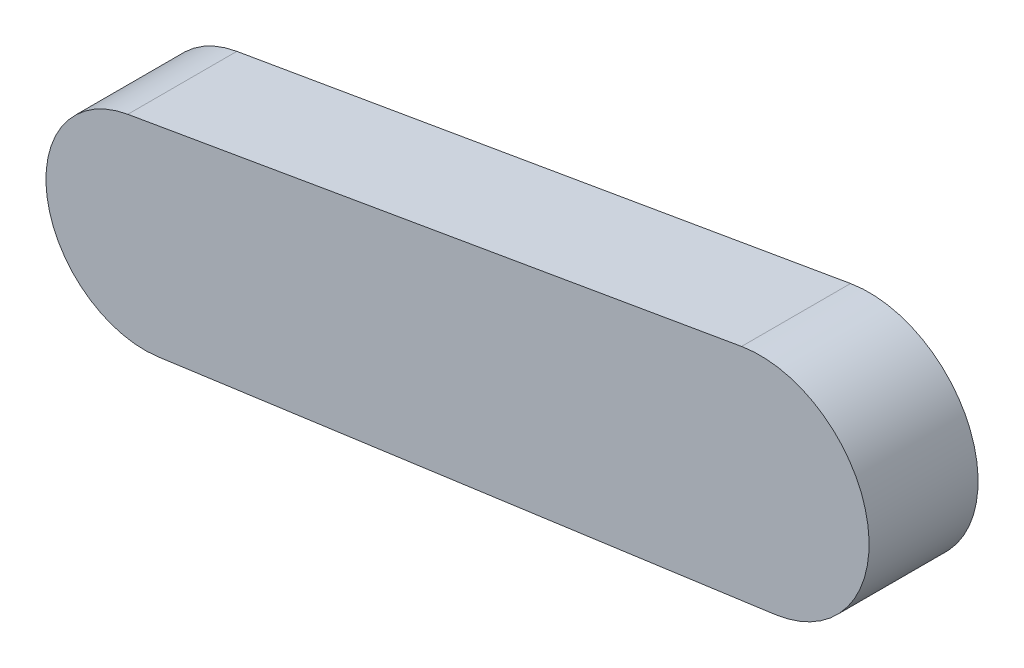
ISO-10303-21;
HEADER;
FILE_DESCRIPTION(('STEP AP214'),'2;1');
FILE_NAME('part.step','',(''),(''),'','','');
FILE_SCHEMA(('AUTOMOTIVE_DESIGN { 1 0 10303 214 1 1 1 1 }'));
ENDSEC;
DATA;
#1=APPLICATION_CONTEXT('core data for automotive mechanical design processes');
#2=APPLICATION_PROTOCOL_DEFINITION('international standard','automotive_design',2000,#1);
#3=PRODUCT_CONTEXT('',#1,'mechanical');
#4=PRODUCT('Part','Part','',(#3));
#5=PRODUCT_RELATED_PRODUCT_CATEGORY('part','',(#4));
#6=PRODUCT_DEFINITION_FORMATION('','',#4);
#7=PRODUCT_DEFINITION_CONTEXT('part definition',#1,'design');
#8=PRODUCT_DEFINITION('design','',#6,#7);
#9=PRODUCT_DEFINITION_SHAPE('','',#8);
#10=(LENGTH_UNIT() NAMED_UNIT(*) SI_UNIT(.MILLI.,.METRE.));
#11=(NAMED_UNIT(*) PLANE_ANGLE_UNIT() SI_UNIT($,.RADIAN.));
#12=(NAMED_UNIT(*) SI_UNIT($,.STERADIAN.) SOLID_ANGLE_UNIT());
#13=UNCERTAINTY_MEASURE_WITH_UNIT(LENGTH_MEASURE(1.E-05),#10,'distance_accuracy_value','');
#14=(GEOMETRIC_REPRESENTATION_CONTEXT(3) GLOBAL_UNCERTAINTY_ASSIGNED_CONTEXT((#13)) GLOBAL_UNIT_ASSIGNED_CONTEXT((#10,
#11,#12)) REPRESENTATION_CONTEXT('',''));
#15=CARTESIAN_POINT('',(0.,0.,0.));
#16=DIRECTION('',(0.,0.,1.));
#17=DIRECTION('',(1.,0.,0.));
#18=AXIS2_PLACEMENT_3D('',#15,#16,#17);
#19=CARTESIAN_POINT('',(-113.968011841731,660.94786327718,53.34));
#20=DIRECTION('',(-0.169923544106424,0.985457248772524,0.));
#21=DIRECTION('',(-0.985457248772524,-0.169923544106424,0.));
#22=AXIS2_PLACEMENT_3D('',#19,#20,#21);
#23=PLANE('',#22);
#24=DIRECTION('',(0.985457248772524,0.169923544106424,0.));
#25=VECTOR('',#24,1.);
#26=CARTESIAN_POINT('',(-113.968011841731,660.94786327718,0.));
#27=LINE('',#26,#25);
#28=CARTESIAN_POINT('',(-999.93937070584,508.178787335535,0.));
#29=VERTEX_POINT('',#28);
#30=CARTESIAN_POINT('',(-699.613721867637,559.964289649526,0.));
#31=VERTEX_POINT('',#30);
#32=EDGE_CURVE('E100',#29,#31,#27,.T.);
#33=ORIENTED_EDGE('',*,*,#32,.F.);
#34=DIRECTION('',(0.,0.,-1.));
#35=VECTOR('',#34,1.);
#36=CARTESIAN_POINT('',(-999.93937070584,508.178787335535,53.34));
#37=LINE('',#36,#35);
#38=CARTESIAN_POINT('',(-999.93937070584,508.178787335535,53.34));
#39=VERTEX_POINT('',#38);
#40=EDGE_CURVE('E11',#39,#29,#37,.T.);
#41=ORIENTED_EDGE('',*,*,#40,.F.);
#42=DIRECTION('',(0.985457248772524,0.169923544106424,0.));
#43=VECTOR('',#42,1.);
#44=CARTESIAN_POINT('',(-113.968011841731,660.94786327718,53.34));
#45=LINE('',#44,#43);
#46=CARTESIAN_POINT('',(-699.613721867637,559.964289649526,53.34));
#47=VERTEX_POINT('',#46);
#48=EDGE_CURVE('E85',#39,#47,#45,.T.);
#49=ORIENTED_EDGE('',*,*,#48,.T.);
#50=DIRECTION('',(0.,0.,-1.));
#51=VECTOR('',#50,1.);
#52=CARTESIAN_POINT('',(-699.613721867637,559.964289649526,53.34));
#53=LINE('',#52,#51);
#54=EDGE_CURVE('E53',#47,#31,#53,.T.);
#55=ORIENTED_EDGE('',*,*,#54,.T.);
#56=EDGE_LOOP('',(#33,#41,#49,#55));
#57=FACE_BOUND('',#56,.T.);
#58=ADVANCED_FACE('F37',(#57),#23,.T.);
#59=CARTESIAN_POINT('',(-991.738860467264,460.620620509774,53.34));
#60=DIRECTION('',(0.,0.,-1.));
#61=DIRECTION('',(-1.,0.,0.));
#62=AXIS2_PLACEMENT_3D('',#59,#60,#61);
#63=CYLINDRICAL_SURFACE('',#62,48.26);
#64=CARTESIAN_POINT('',(-991.738860467264,460.620620509774,0.));
#65=DIRECTION('',(0.,0.,1.));
#66=DIRECTION('',(1.,0.,0.));
#67=AXIS2_PLACEMENT_3D('',#64,#65,#66);
#68=CIRCLE('',#67,48.26);
#69=CARTESIAN_POINT('',(-985.127958103244,412.81556251448,0.));
#70=VERTEX_POINT('',#69);
#71=EDGE_CURVE('E91',#29,#70,#68,.T.);
#72=ORIENTED_EDGE('',*,*,#71,.T.);
#73=DIRECTION('',(0.,0.,-1.));
#74=VECTOR('',#73,1.);
#75=CARTESIAN_POINT('',(-985.127958103244,412.81556251448,53.34));
#76=LINE('',#75,#74);
#77=CARTESIAN_POINT('',(-985.127958103244,412.81556251448,53.34));
#78=VERTEX_POINT('',#77);
#79=EDGE_CURVE('E45',#78,#70,#76,.T.);
#80=ORIENTED_EDGE('',*,*,#79,.F.);
#81=CARTESIAN_POINT('',(-991.738860467264,460.620620509774,53.34));
#82=DIRECTION('',(0.,0.,1.));
#83=DIRECTION('',(1.,0.,0.));
#84=AXIS2_PLACEMENT_3D('',#81,#82,#83);
#85=CIRCLE('',#84,48.26);
#86=EDGE_CURVE('E79',#39,#78,#85,.T.);
#87=ORIENTED_EDGE('',*,*,#86,.F.);
#88=ORIENTED_EDGE('',*,*,#40,.T.);
#89=EDGE_LOOP('',(#72,#80,#87,#88));
#90=FACE_BOUND('',#89,.T.);
#91=ADVANCED_FACE('F89',(#90),#63,.T.);
#92=CARTESIAN_POINT('',(-74.502359296189,538.744850676477,53.34));
#93=DIRECTION('',(0.13698512979734,-0.990573103922374,0.));
#94=DIRECTION('',(0.990573103922374,0.13698512979734,0.));
#95=AXIS2_PLACEMENT_3D('',#92,#93,#94);
#96=PLANE('',#95);
#97=DIRECTION('',(-0.990573103922374,-0.13698512979734,0.));
#98=VECTOR('',#97,1.);
#99=CARTESIAN_POINT('',(-74.502359296189,538.744850676477,0.));
#100=LINE('',#99,#98);
#101=CARTESIAN_POINT('',(-683.243213201611,454.562830636781,0.));
#102=VERTEX_POINT('',#101);
#103=EDGE_CURVE('E103',#102,#70,#100,.T.);
#104=ORIENTED_EDGE('',*,*,#103,.F.);
#105=DIRECTION('',(0.,0.,-1.));
#106=VECTOR('',#105,1.);
#107=CARTESIAN_POINT('',(-683.243213201611,454.562830636781,53.34));
#108=LINE('',#107,#106);
#109=CARTESIAN_POINT('',(-683.243213201611,454.562830636781,53.34));
#110=VERTEX_POINT('',#109);
#111=EDGE_CURVE('E66',#110,#102,#108,.T.);
#112=ORIENTED_EDGE('',*,*,#111,.F.);
#113=DIRECTION('',(-0.990573103922374,-0.13698512979734,0.));
#114=VECTOR('',#113,1.);
#115=CARTESIAN_POINT('',(-74.502359296189,538.744850676477,53.34));
#116=LINE('',#115,#114);
#117=EDGE_CURVE('E84',#110,#78,#116,.T.);
#118=ORIENTED_EDGE('',*,*,#117,.T.);
#119=ORIENTED_EDGE('',*,*,#79,.T.);
#120=EDGE_LOOP('',(#104,#112,#118,#119));
#121=FACE_BOUND('',#120,.T.);
#122=ADVANCED_FACE('F94',(#121),#96,.T.);
#123=CARTESIAN_POINT('',(-690.550000025001,507.4,53.34));
#124=DIRECTION('',(0.,0.,-1.));
#125=DIRECTION('',(-1.,0.,0.));
#126=AXIS2_PLACEMENT_3D('',#123,#124,#125);
#127=CYLINDRICAL_SURFACE('',#126,53.3399999999999);
#128=CARTESIAN_POINT('',(-690.550000025001,507.4,0.));
#129=DIRECTION('',(0.,0.,1.));
#130=DIRECTION('',(1.,0.,0.));
#131=AXIS2_PLACEMENT_3D('',#128,#129,#130);
#132=CIRCLE('',#131,53.3399999999999);
#133=EDGE_CURVE('E105',#31,#102,#132,.F.);
#134=ORIENTED_EDGE('',*,*,#133,.F.);
#135=ORIENTED_EDGE('',*,*,#54,.F.);
#136=CARTESIAN_POINT('',(-690.550000025001,507.4,53.34));
#137=DIRECTION('',(0.,0.,1.));
#138=DIRECTION('',(1.,0.,0.));
#139=AXIS2_PLACEMENT_3D('',#136,#137,#138);
#140=CIRCLE('',#139,53.3399999999999);
#141=EDGE_CURVE('E95',#47,#110,#140,.F.);
#142=ORIENTED_EDGE('',*,*,#141,.T.);
#143=ORIENTED_EDGE('',*,*,#111,.T.);
#144=EDGE_LOOP('',(#134,#135,#142,#143));
#145=FACE_BOUND('',#144,.T.);
#146=ADVANCED_FACE('F110',(#145),#127,.T.);
#147=CARTESIAN_POINT('',(0.,0.,53.34));
#148=DIRECTION('',(0.,0.,1.));
#149=DIRECTION('',(1.,0.,0.));
#150=AXIS2_PLACEMENT_3D('',#147,#148,#149);
#151=PLANE('',#150);
#152=ORIENTED_EDGE('',*,*,#48,.F.);
#153=ORIENTED_EDGE('',*,*,#86,.T.);
#154=ORIENTED_EDGE('',*,*,#117,.F.);
#155=ORIENTED_EDGE('',*,*,#141,.F.);
#156=EDGE_LOOP('',(#152,#153,#154,#155));
#157=FACE_BOUND('',#156,.T.);
#158=ADVANCED_FACE('F81',(#157),#151,.T.);
#159=CARTESIAN_POINT('',(0.,0.,0.));
#160=DIRECTION('',(0.,0.,1.));
#161=DIRECTION('',(1.,0.,0.));
#162=AXIS2_PLACEMENT_3D('',#159,#160,#161);
#163=PLANE('',#162);
#164=ORIENTED_EDGE('',*,*,#32,.T.);
#165=ORIENTED_EDGE('',*,*,#133,.T.);
#166=ORIENTED_EDGE('',*,*,#103,.T.);
#167=ORIENTED_EDGE('',*,*,#71,.F.);
#168=EDGE_LOOP('',(#164,#165,#166,#167));
#169=FACE_BOUND('',#168,.T.);
#170=ADVANCED_FACE('F117',(#169),#163,.F.);
#171=CLOSED_SHELL('',(#58,#91,#122,#146,#158,#170));
#172=MANIFOLD_SOLID_BREP('B2',#171);
#173=ADVANCED_BREP_SHAPE_REPRESENTATION('',(#18,#172),#14);
#174=SHAPE_DEFINITION_REPRESENTATION(#9,#173);
ENDSEC;
END-ISO-10303-21;
